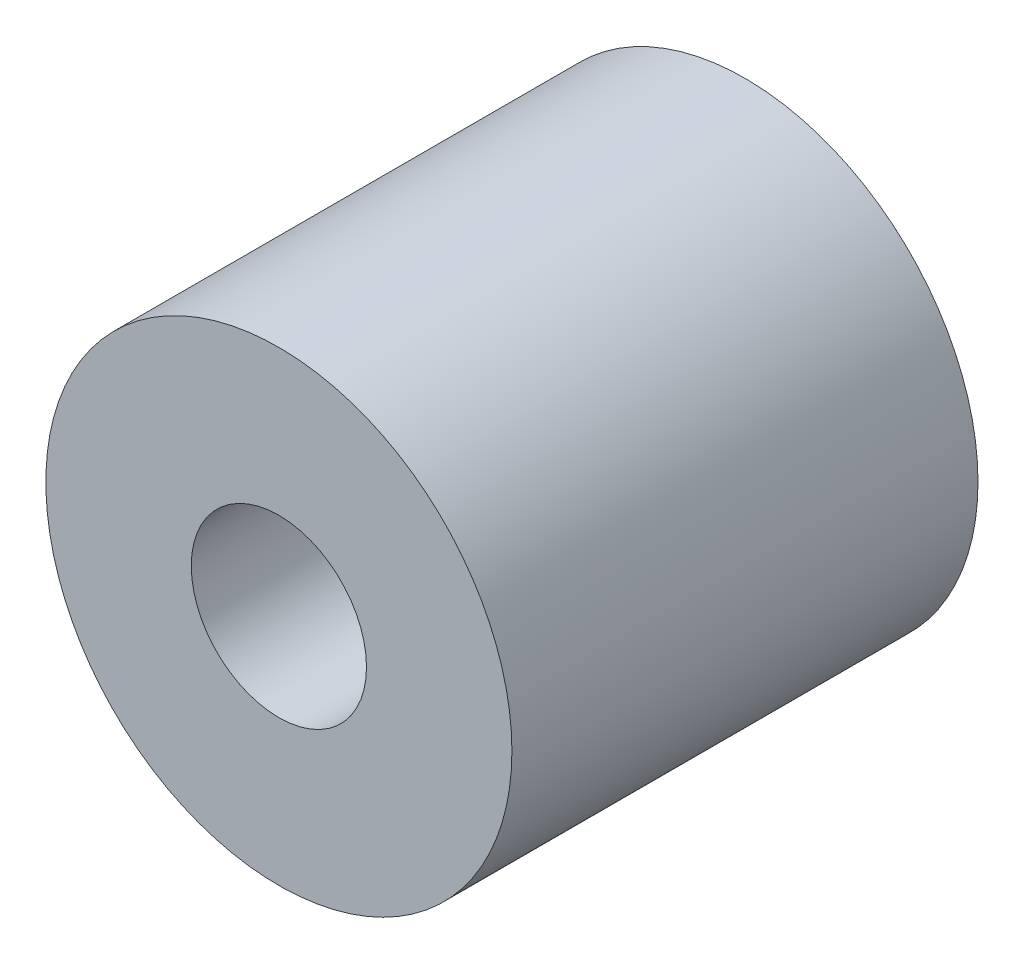
ISO-10303-21;
HEADER;
FILE_DESCRIPTION(('STEP AP214'),'2;1');
FILE_NAME('part.step','',(''),(''),'','','');
FILE_SCHEMA(('AUTOMOTIVE_DESIGN { 1 0 10303 214 1 1 1 1 }'));
ENDSEC;
DATA;
#1=APPLICATION_CONTEXT('core data for automotive mechanical design processes');
#2=APPLICATION_PROTOCOL_DEFINITION('international standard','automotive_design',2000,#1);
#3=PRODUCT_CONTEXT('',#1,'mechanical');
#4=PRODUCT('Part','Part','',(#3));
#5=PRODUCT_RELATED_PRODUCT_CATEGORY('part','',(#4));
#6=PRODUCT_DEFINITION_FORMATION('','',#4);
#7=PRODUCT_DEFINITION_CONTEXT('part definition',#1,'design');
#8=PRODUCT_DEFINITION('design','',#6,#7);
#9=PRODUCT_DEFINITION_SHAPE('','',#8);
#10=(LENGTH_UNIT() NAMED_UNIT(*) SI_UNIT(.MILLI.,.METRE.));
#11=(NAMED_UNIT(*) PLANE_ANGLE_UNIT() SI_UNIT($,.RADIAN.));
#12=(NAMED_UNIT(*) SI_UNIT($,.STERADIAN.) SOLID_ANGLE_UNIT());
#13=UNCERTAINTY_MEASURE_WITH_UNIT(LENGTH_MEASURE(1.E-05),#10,'distance_accuracy_value','');
#14=(GEOMETRIC_REPRESENTATION_CONTEXT(3) GLOBAL_UNCERTAINTY_ASSIGNED_CONTEXT((#13)) GLOBAL_UNIT_ASSIGNED_CONTEXT((#10,
#11,#12)) REPRESENTATION_CONTEXT('',''));
#15=CARTESIAN_POINT('',(0.,0.,0.));
#16=DIRECTION('',(0.,0.,1.));
#17=DIRECTION('',(1.,0.,0.));
#18=AXIS2_PLACEMENT_3D('',#15,#16,#17);
#19=CARTESIAN_POINT('',(0.,0.,3.175));
#20=DIRECTION('',(0.,0.,1.));
#21=DIRECTION('',(1.,0.,0.));
#22=AXIS2_PLACEMENT_3D('',#19,#20,#21);
#23=PLANE('',#22);
#24=CARTESIAN_POINT('',(0.,0.,3.175));
#25=DIRECTION('',(0.,0.,1.));
#26=DIRECTION('',(1.,0.,0.));
#27=AXIS2_PLACEMENT_3D('',#24,#25,#26);
#28=CIRCLE('',#27,3.175);
#29=CARTESIAN_POINT('',(3.175,0.,3.175));
#30=VERTEX_POINT('',#29);
#31=EDGE_CURVE('E10',#30,#30,#28,.T.);
#32=ORIENTED_EDGE('',*,*,#31,.T.);
#33=EDGE_LOOP('',(#32));
#34=FACE_BOUND('',#33,.T.);
#35=CARTESIAN_POINT('',(0.,0.,3.175));
#36=DIRECTION('',(0.,0.,1.));
#37=DIRECTION('',(1.,0.,0.));
#38=AXIS2_PLACEMENT_3D('',#35,#36,#37);
#39=CIRCLE('',#38,1.1938);
#40=CARTESIAN_POINT('',(1.1938,0.,3.175));
#41=VERTEX_POINT('',#40);
#42=EDGE_CURVE('E41',#41,#41,#39,.T.);
#43=ORIENTED_EDGE('',*,*,#42,.F.);
#44=EDGE_LOOP('',(#43));
#45=FACE_BOUND('',#44,.T.);
#46=ADVANCED_FACE('F30',(#34,#45),#23,.T.);
#47=CARTESIAN_POINT('',(0.,0.,-3.175));
#48=DIRECTION('',(0.,0.,1.));
#49=DIRECTION('',(1.,0.,0.));
#50=AXIS2_PLACEMENT_3D('',#47,#48,#49);
#51=PLANE('',#50);
#52=CARTESIAN_POINT('',(0.,0.,-3.175));
#53=DIRECTION('',(0.,0.,1.));
#54=DIRECTION('',(1.,0.,0.));
#55=AXIS2_PLACEMENT_3D('',#52,#53,#54);
#56=CIRCLE('',#55,3.175);
#57=CARTESIAN_POINT('',(3.175,0.,-3.175));
#58=VERTEX_POINT('',#57);
#59=EDGE_CURVE('E34',#58,#58,#56,.T.);
#60=ORIENTED_EDGE('',*,*,#59,.F.);
#61=EDGE_LOOP('',(#60));
#62=FACE_BOUND('',#61,.T.);
#63=CARTESIAN_POINT('',(0.,0.,-3.175));
#64=DIRECTION('',(0.,0.,1.));
#65=DIRECTION('',(1.,0.,0.));
#66=AXIS2_PLACEMENT_3D('',#63,#64,#65);
#67=CIRCLE('',#66,1.1938);
#68=CARTESIAN_POINT('',(1.1938,0.,-3.175));
#69=VERTEX_POINT('',#68);
#70=EDGE_CURVE('E43',#69,#69,#67,.T.);
#71=ORIENTED_EDGE('',*,*,#70,.T.);
#72=EDGE_LOOP('',(#71));
#73=FACE_BOUND('',#72,.T.);
#74=ADVANCED_FACE('F53',(#62,#73),#51,.F.);
#75=CARTESIAN_POINT('',(0.,0.,3.175));
#76=DIRECTION('',(0.,0.,-1.));
#77=DIRECTION('',(-1.,0.,0.));
#78=AXIS2_PLACEMENT_3D('',#75,#76,#77);
#79=CYLINDRICAL_SURFACE('',#78,3.175);
#80=ORIENTED_EDGE('',*,*,#31,.F.);
#81=EDGE_LOOP('',(#80));
#82=FACE_BOUND('',#81,.T.);
#83=ORIENTED_EDGE('',*,*,#59,.T.);
#84=EDGE_LOOP('',(#83));
#85=FACE_BOUND('',#84,.T.);
#86=ADVANCED_FACE('F32',(#82,#85),#79,.T.);
#87=CARTESIAN_POINT('',(0.,0.,3.175));
#88=DIRECTION('',(0.,0.,-1.));
#89=DIRECTION('',(-1.,0.,0.));
#90=AXIS2_PLACEMENT_3D('',#87,#88,#89);
#91=CYLINDRICAL_SURFACE('',#90,1.1938);
#92=ORIENTED_EDGE('',*,*,#42,.T.);
#93=EDGE_LOOP('',(#92));
#94=FACE_BOUND('',#93,.T.);
#95=ORIENTED_EDGE('',*,*,#70,.F.);
#96=EDGE_LOOP('',(#95));
#97=FACE_BOUND('',#96,.T.);
#98=ADVANCED_FACE('F49',(#94,#97),#91,.F.);
#99=CLOSED_SHELL('',(#46,#74,#86,#98));
#100=MANIFOLD_SOLID_BREP('B2',#99);
#101=ADVANCED_BREP_SHAPE_REPRESENTATION('',(#18,#100),#14);
#102=SHAPE_DEFINITION_REPRESENTATION(#9,#101);
ENDSEC;
END-ISO-10303-21;
